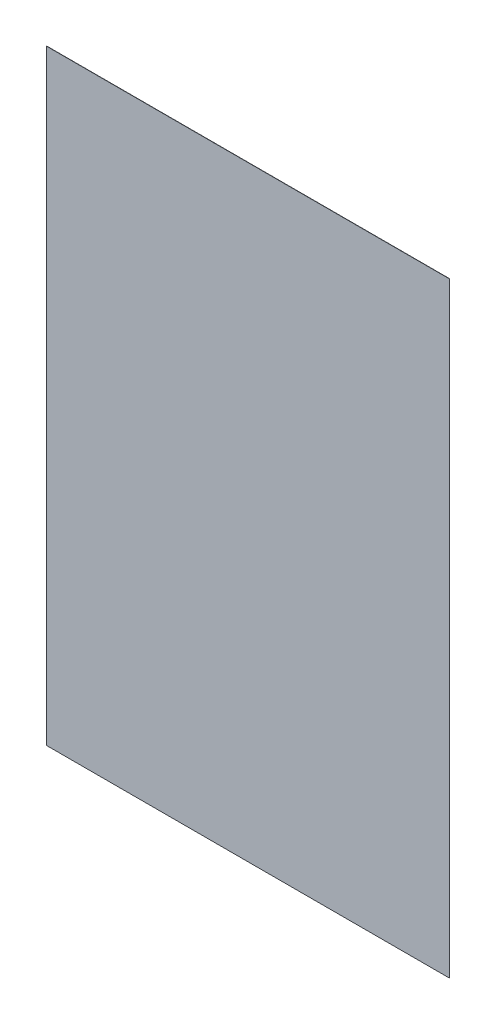
ISO-10303-21;
HEADER;
FILE_DESCRIPTION(('STEP AP214'),'2;1');
FILE_NAME('part.step','',(''),(''),'','','');
FILE_SCHEMA(('AUTOMOTIVE_DESIGN { 1 0 10303 214 1 1 1 1 }'));
ENDSEC;
DATA;
#1=APPLICATION_CONTEXT('core data for automotive mechanical design processes');
#2=APPLICATION_PROTOCOL_DEFINITION('international standard','automotive_design',2000,#1);
#3=PRODUCT_CONTEXT('',#1,'mechanical');
#4=PRODUCT('Part','Part','',(#3));
#5=PRODUCT_RELATED_PRODUCT_CATEGORY('part','',(#4));
#6=PRODUCT_DEFINITION_FORMATION('','',#4);
#7=PRODUCT_DEFINITION_CONTEXT('part definition',#1,'design');
#8=PRODUCT_DEFINITION('design','',#6,#7);
#9=PRODUCT_DEFINITION_SHAPE('','',#8);
#10=(LENGTH_UNIT() NAMED_UNIT(*) SI_UNIT(.MILLI.,.METRE.));
#11=(NAMED_UNIT(*) PLANE_ANGLE_UNIT() SI_UNIT($,.RADIAN.));
#12=(NAMED_UNIT(*) SI_UNIT($,.STERADIAN.) SOLID_ANGLE_UNIT());
#13=UNCERTAINTY_MEASURE_WITH_UNIT(LENGTH_MEASURE(1.E-05),#10,'distance_accuracy_value','');
#14=(GEOMETRIC_REPRESENTATION_CONTEXT(3) GLOBAL_UNCERTAINTY_ASSIGNED_CONTEXT((#13)) GLOBAL_UNIT_ASSIGNED_CONTEXT((#10,
#11,#12)) REPRESENTATION_CONTEXT('',''));
#15=CARTESIAN_POINT('',(0.,0.,0.));
#16=DIRECTION('',(0.,0.,1.));
#17=DIRECTION('',(1.,0.,0.));
#18=AXIS2_PLACEMENT_3D('',#15,#16,#17);
#19=CARTESIAN_POINT('',(-2.460209573344E-05,-6.476474536692E-05,0.00100076));
#20=DIRECTION('',(0.,0.,1.));
#21=DIRECTION('',(1.,0.,0.));
#22=AXIS2_PLACEMENT_3D('',#19,#20,#21);
#23=PLANE('',#22);
#24=DIRECTION('',(1.05810028549447E-06,0.99999999999944,0.));
#25=VECTOR('',#24,1.);
#26=CARTESIAN_POINT('',(0.7983728,-1.20039384,0.00100076));
#27=LINE('',#26,#25);
#28=CARTESIAN_POINT('',(0.7983728,-1.20039384,0.00100076));
#29=VERTEX_POINT('',#28);
#30=CARTESIAN_POINT('',(0.79837534,1.20013476,0.00100076));
#31=VERTEX_POINT('',#30);
#32=EDGE_CURVE('E81',#29,#31,#27,.T.);
#33=ORIENTED_EDGE('',*,*,#32,.T.);
#34=DIRECTION('',(-0.999999986836653,0.000162255024587944,0.));
#35=VECTOR('',#34,1.);
#36=CARTESIAN_POINT('',(0.79837534,1.20013476,0.00100076));
#37=LINE('',#36,#35);
#38=CARTESIAN_POINT('',(-0.79837026,1.20039384,0.00100076));
#39=VERTEX_POINT('',#38);
#40=EDGE_CURVE('E103',#31,#39,#37,.T.);
#41=ORIENTED_EDGE('',*,*,#40,.T.);
#42=DIRECTION('',(-1.05798609512447E-06,-0.99999999999944,0.));
#43=VECTOR('',#42,1.);
#44=CARTESIAN_POINT('',(-0.79837026,1.20039384,0.00100076));
#45=LINE('',#44,#43);
#46=CARTESIAN_POINT('',(-0.7983728,-1.20039384,0.00100076));
#47=VERTEX_POINT('',#46);
#48=EDGE_CURVE('E74',#39,#47,#45,.T.);
#49=ORIENTED_EDGE('',*,*,#48,.T.);
#50=DIRECTION('',(1.,0.,0.));
#51=VECTOR('',#50,1.);
#52=CARTESIAN_POINT('',(-0.7983728,-1.20039384,0.00100076));
#53=LINE('',#52,#51);
#54=EDGE_CURVE('E11',#47,#29,#53,.T.);
#55=ORIENTED_EDGE('',*,*,#54,.T.);
#56=EDGE_LOOP('',(#33,#41,#49,#55));
#57=FACE_BOUND('',#56,.T.);
#58=ADVANCED_FACE('F17',(#57),#23,.T.);
#59=CARTESIAN_POINT('',(-2.460209573344E-05,-6.476474536692E-05,0.));
#60=DIRECTION('',(0.,0.,1.));
#61=DIRECTION('',(1.,0.,0.));
#62=AXIS2_PLACEMENT_3D('',#59,#60,#61);
#63=PLANE('',#62);
#64=DIRECTION('',(1.,0.,0.));
#65=VECTOR('',#64,1.);
#66=CARTESIAN_POINT('',(-0.7983728,-1.20039384,0.));
#67=LINE('',#66,#65);
#68=CARTESIAN_POINT('',(-0.7983728,-1.20039384,0.));
#69=VERTEX_POINT('',#68);
#70=CARTESIAN_POINT('',(0.7983728,-1.20039384,0.));
#71=VERTEX_POINT('',#70);
#72=EDGE_CURVE('E20',#69,#71,#67,.T.);
#73=ORIENTED_EDGE('',*,*,#72,.F.);
#74=DIRECTION('',(-1.05798609512447E-06,-0.99999999999944,0.));
#75=VECTOR('',#74,1.);
#76=CARTESIAN_POINT('',(-0.79837026,1.20039384,0.));
#77=LINE('',#76,#75);
#78=CARTESIAN_POINT('',(-0.79837026,1.20039384,0.));
#79=VERTEX_POINT('',#78);
#80=EDGE_CURVE('E109',#79,#69,#77,.T.);
#81=ORIENTED_EDGE('',*,*,#80,.F.);
#82=DIRECTION('',(-0.999999986836653,0.000162255024587944,0.));
#83=VECTOR('',#82,1.);
#84=CARTESIAN_POINT('',(0.79837534,1.20013476,0.));
#85=LINE('',#84,#83);
#86=CARTESIAN_POINT('',(0.79837534,1.20013476,0.));
#87=VERTEX_POINT('',#86);
#88=EDGE_CURVE('E83',#87,#79,#85,.T.);
#89=ORIENTED_EDGE('',*,*,#88,.F.);
#90=DIRECTION('',(1.05810028549447E-06,0.99999999999944,0.));
#91=VECTOR('',#90,1.);
#92=CARTESIAN_POINT('',(0.7983728,-1.20039384,0.));
#93=LINE('',#92,#91);
#94=EDGE_CURVE('E79',#71,#87,#93,.T.);
#95=ORIENTED_EDGE('',*,*,#94,.F.);
#96=EDGE_LOOP('',(#73,#81,#89,#95));
#97=FACE_BOUND('',#96,.T.);
#98=ADVANCED_FACE('F85',(#97),#63,.F.);
#99=CARTESIAN_POINT('',(-0.7983728,-1.20039384,0.));
#100=DIRECTION('',(0.,1.,0.));
#101=DIRECTION('',(1.,0.,0.));
#102=AXIS2_PLACEMENT_3D('',#99,#100,#101);
#103=PLANE('',#102);
#104=ORIENTED_EDGE('',*,*,#72,.T.);
#105=DIRECTION('',(0.,0.,1.));
#106=VECTOR('',#105,1.);
#107=CARTESIAN_POINT('',(0.7983728,-1.20039384,0.));
#108=LINE('',#107,#106);
#109=EDGE_CURVE('E68',#71,#29,#108,.T.);
#110=ORIENTED_EDGE('',*,*,#109,.T.);
#111=ORIENTED_EDGE('',*,*,#54,.F.);
#112=DIRECTION('',(0.,0.,1.));
#113=VECTOR('',#112,1.);
#114=CARTESIAN_POINT('',(-0.7983728,-1.20039384,0.));
#115=LINE('',#114,#113);
#116=EDGE_CURVE('E71',#69,#47,#115,.T.);
#117=ORIENTED_EDGE('',*,*,#116,.F.);
#118=EDGE_LOOP('',(#104,#110,#111,#117));
#119=FACE_BOUND('',#118,.T.);
#120=ADVANCED_FACE('F67',(#119),#103,.F.);
#121=CARTESIAN_POINT('',(-0.79837026,1.20039384,0.));
#122=DIRECTION('',(0.99999999999944,-1.05798609512447E-06,0.));
#123=DIRECTION('',(0.,0.,-1.));
#124=AXIS2_PLACEMENT_3D('',#121,#122,#123);
#125=PLANE('',#124);
#126=ORIENTED_EDGE('',*,*,#80,.T.);
#127=ORIENTED_EDGE('',*,*,#116,.T.);
#128=ORIENTED_EDGE('',*,*,#48,.F.);
#129=DIRECTION('',(0.,0.,1.));
#130=VECTOR('',#129,1.);
#131=CARTESIAN_POINT('',(-0.79837026,1.20039384,0.));
#132=LINE('',#131,#130);
#133=EDGE_CURVE('E99',#79,#39,#132,.T.);
#134=ORIENTED_EDGE('',*,*,#133,.F.);
#135=EDGE_LOOP('',(#126,#127,#128,#134));
#136=FACE_BOUND('',#135,.T.);
#137=ADVANCED_FACE('F118',(#136),#125,.F.);
#138=CARTESIAN_POINT('',(0.79837534,1.20013476,0.));
#139=DIRECTION('',(-0.000162255024587944,-0.999999986836653,0.));
#140=DIRECTION('',(-0.999999986836653,0.000162255024587944,0.));
#141=AXIS2_PLACEMENT_3D('',#138,#139,#140);
#142=PLANE('',#141);
#143=ORIENTED_EDGE('',*,*,#88,.T.);
#144=ORIENTED_EDGE('',*,*,#133,.T.);
#145=ORIENTED_EDGE('',*,*,#40,.F.);
#146=DIRECTION('',(0.,0.,1.));
#147=VECTOR('',#146,1.);
#148=CARTESIAN_POINT('',(0.79837534,1.20013476,0.));
#149=LINE('',#148,#147);
#150=EDGE_CURVE('E89',#87,#31,#149,.T.);
#151=ORIENTED_EDGE('',*,*,#150,.F.);
#152=EDGE_LOOP('',(#143,#144,#145,#151));
#153=FACE_BOUND('',#152,.T.);
#154=ADVANCED_FACE('F120',(#153),#142,.F.);
#155=CARTESIAN_POINT('',(0.7983728,-1.20039384,0.));
#156=DIRECTION('',(-0.99999999999944,1.05810028549447E-06,0.));
#157=DIRECTION('',(0.,0.,1.));
#158=AXIS2_PLACEMENT_3D('',#155,#156,#157);
#159=PLANE('',#158);
#160=ORIENTED_EDGE('',*,*,#94,.T.);
#161=ORIENTED_EDGE('',*,*,#150,.T.);
#162=ORIENTED_EDGE('',*,*,#32,.F.);
#163=ORIENTED_EDGE('',*,*,#109,.F.);
#164=EDGE_LOOP('',(#160,#161,#162,#163));
#165=FACE_BOUND('',#164,.T.);
#166=ADVANCED_FACE('F77',(#165),#159,.F.);
#167=CLOSED_SHELL('',(#58,#98,#120,#137,#154,#166));
#168=MANIFOLD_SOLID_BREP('B1',#167);
#169=ADVANCED_BREP_SHAPE_REPRESENTATION('',(#18,#168),#14);
#170=SHAPE_DEFINITION_REPRESENTATION(#9,#169);
ENDSEC;
END-ISO-10303-21;
